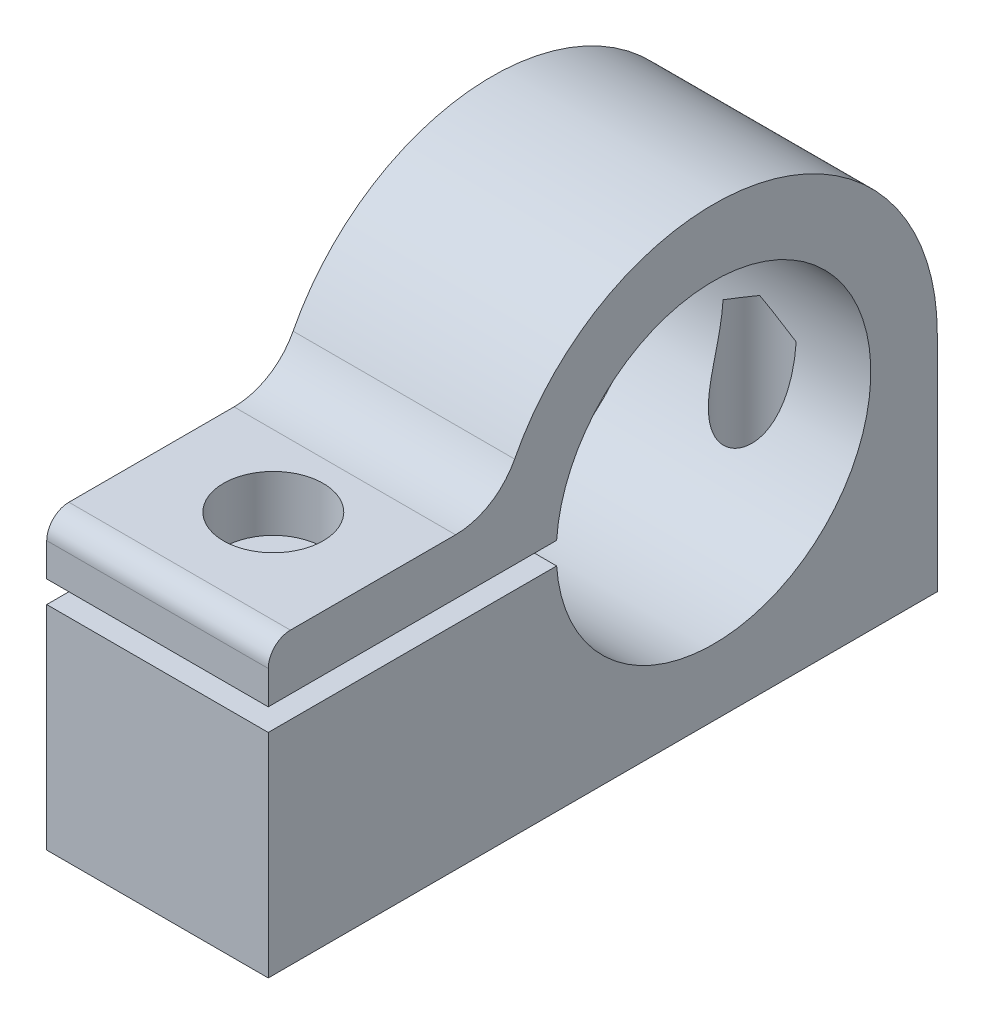
ISO-10303-21;
HEADER;
FILE_DESCRIPTION(('STEP AP214'),'2;1');
FILE_NAME('part.step','',(''),(''),'','','');
FILE_SCHEMA(('AUTOMOTIVE_DESIGN { 1 0 10303 214 1 1 1 1 }'));
ENDSEC;
DATA;
#1=APPLICATION_CONTEXT('core data for automotive mechanical design processes');
#2=APPLICATION_PROTOCOL_DEFINITION('international standard','automotive_design',2000,#1);
#3=PRODUCT_CONTEXT('',#1,'mechanical');
#4=PRODUCT('Part','Part','',(#3));
#5=PRODUCT_RELATED_PRODUCT_CATEGORY('part','',(#4));
#6=PRODUCT_DEFINITION_FORMATION('','',#4);
#7=PRODUCT_DEFINITION_CONTEXT('part definition',#1,'design');
#8=PRODUCT_DEFINITION('design','',#6,#7);
#9=PRODUCT_DEFINITION_SHAPE('','',#8);
#10=(LENGTH_UNIT() NAMED_UNIT(*) SI_UNIT(.MILLI.,.METRE.));
#11=(NAMED_UNIT(*) PLANE_ANGLE_UNIT() SI_UNIT($,.RADIAN.));
#12=(NAMED_UNIT(*) SI_UNIT($,.STERADIAN.) SOLID_ANGLE_UNIT());
#13=UNCERTAINTY_MEASURE_WITH_UNIT(LENGTH_MEASURE(1.E-05),#10,'distance_accuracy_value','');
#14=(GEOMETRIC_REPRESENTATION_CONTEXT(3) GLOBAL_UNCERTAINTY_ASSIGNED_CONTEXT((#13)) GLOBAL_UNIT_ASSIGNED_CONTEXT((#10,
#11,#12)) REPRESENTATION_CONTEXT('',''));
#15=CARTESIAN_POINT('',(0.,0.,0.));
#16=DIRECTION('',(0.,0.,1.));
#17=DIRECTION('',(1.,0.,0.));
#18=AXIS2_PLACEMENT_3D('',#15,#16,#17);
#19=CARTESIAN_POINT('',(0.,-0.5,7.08237248385031));
#20=DIRECTION('',(0.,-1.,0.));
#21=DIRECTION('',(0.,0.,-1.));
#22=AXIS2_PLACEMENT_3D('',#19,#20,#21);
#23=PLANE('',#22);
#24=CARTESIAN_POINT('',(5.,-0.5,14.8720846114518));
#25=DIRECTION('',(0.,-1.,0.));
#26=DIRECTION('',(0.,0.,-1.));
#27=AXIS2_PLACEMENT_3D('',#24,#25,#26);
#28=CIRCLE('',#27,1.64999999999999);
#29=CARTESIAN_POINT('',(5.,-0.5,13.2220846114518));
#30=VERTEX_POINT('',#29);
#31=EDGE_CURVE('E228',#30,#30,#28,.F.);
#32=ORIENTED_EDGE('',*,*,#31,.F.);
#33=EDGE_LOOP('',(#32));
#34=FACE_BOUND('',#33,.T.);
#35=DIRECTION('',(0.,0.,-1.));
#36=VECTOR('',#35,1.);
#37=CARTESIAN_POINT('',(10.,-0.5,7.08237248385031));
#38=LINE('',#37,#36);
#39=CARTESIAN_POINT('',(10.,-0.5,20.1));
#40=VERTEX_POINT('',#39);
#41=CARTESIAN_POINT('',(10.,-0.5,7.08237248385031));
#42=VERTEX_POINT('',#41);
#43=EDGE_CURVE('E434',#40,#42,#38,.T.);
#44=ORIENTED_EDGE('',*,*,#43,.T.);
#45=DIRECTION('',(1.,0.,0.));
#46=VECTOR('',#45,1.);
#47=CARTESIAN_POINT('',(0.,-0.499999999999997,7.08237248385031));
#48=LINE('',#47,#46);
#49=CARTESIAN_POINT('',(0.,-0.499999999999997,7.08237248385031));
#50=VERTEX_POINT('',#49);
#51=EDGE_CURVE('E260',#50,#42,#48,.T.);
#52=ORIENTED_EDGE('',*,*,#51,.F.);
#53=DIRECTION('',(0.,0.,-1.));
#54=VECTOR('',#53,1.);
#55=CARTESIAN_POINT('',(0.,-0.5,7.08237248385031));
#56=LINE('',#55,#54);
#57=CARTESIAN_POINT('',(0.,-0.5,20.1));
#58=VERTEX_POINT('',#57);
#59=EDGE_CURVE('E264',#58,#50,#56,.T.);
#60=ORIENTED_EDGE('',*,*,#59,.F.);
#61=DIRECTION('',(1.,0.,0.));
#62=VECTOR('',#61,1.);
#63=CARTESIAN_POINT('',(0.,-0.5,20.1));
#64=LINE('',#63,#62);
#65=EDGE_CURVE('E430',#58,#40,#64,.T.);
#66=ORIENTED_EDGE('',*,*,#65,.T.);
#67=EDGE_LOOP('',(#44,#52,#60,#66));
#68=FACE_BOUND('',#67,.T.);
#69=CARTESIAN_POINT('',(5.,-0.5,9.85222854765104));
#70=DIRECTION('',(0.,-1.,0.));
#71=DIRECTION('',(0.,0.,-1.));
#72=AXIS2_PLACEMENT_3D('',#69,#70,#71);
#73=CIRCLE('',#72,1.64999999999999);
#74=CARTESIAN_POINT('',(5.,-0.5,8.20222854765105));
#75=VERTEX_POINT('',#74);
#76=EDGE_CURVE('E449',#75,#75,#73,.F.);
#77=ORIENTED_EDGE('',*,*,#76,.F.);
#78=EDGE_LOOP('',(#77));
#79=FACE_BOUND('',#78,.T.);
#80=ADVANCED_FACE('F37',(#34,#68,#79),#23,.F.);
#81=CARTESIAN_POINT('',(0.,0.5,7.08237248385031));
#82=DIRECTION('',(0.,1.,0.));
#83=DIRECTION('',(0.,0.,1.));
#84=AXIS2_PLACEMENT_3D('',#81,#82,#83);
#85=PLANE('',#84);
#86=DIRECTION('',(0.,0.,1.));
#87=VECTOR('',#86,1.);
#88=CARTESIAN_POINT('',(10.,0.5,7.08237248385031));
#89=LINE('',#88,#87);
#90=CARTESIAN_POINT('',(10.,0.5,7.08237248385031));
#91=VERTEX_POINT('',#90);
#92=CARTESIAN_POINT('',(10.,0.5,20.1));
#93=VERTEX_POINT('',#92);
#94=EDGE_CURVE('E435',#91,#93,#89,.T.);
#95=ORIENTED_EDGE('',*,*,#94,.T.);
#96=DIRECTION('',(1.,0.,0.));
#97=VECTOR('',#96,1.);
#98=CARTESIAN_POINT('',(0.,0.5,20.1));
#99=LINE('',#98,#97);
#100=CARTESIAN_POINT('',(0.,0.5,20.1));
#101=VERTEX_POINT('',#100);
#102=EDGE_CURVE('E232',#101,#93,#99,.T.);
#103=ORIENTED_EDGE('',*,*,#102,.F.);
#104=DIRECTION('',(0.,0.,1.));
#105=VECTOR('',#104,1.);
#106=CARTESIAN_POINT('',(0.,0.5,7.08237248385031));
#107=LINE('',#106,#105);
#108=CARTESIAN_POINT('',(0.,0.5,7.08237248385031));
#109=VERTEX_POINT('',#108);
#110=EDGE_CURVE('E200',#109,#101,#107,.T.);
#111=ORIENTED_EDGE('',*,*,#110,.F.);
#112=DIRECTION('',(1.,0.,0.));
#113=VECTOR('',#112,1.);
#114=CARTESIAN_POINT('',(0.,0.5,7.08237248385031));
#115=LINE('',#114,#113);
#116=EDGE_CURVE('E254',#109,#91,#115,.T.);
#117=ORIENTED_EDGE('',*,*,#116,.T.);
#118=EDGE_LOOP('',(#95,#103,#111,#117));
#119=FACE_BOUND('',#118,.T.);
#120=CARTESIAN_POINT('',(5.,0.5,14.8720846114518));
#121=DIRECTION('',(0.,1.,0.));
#122=DIRECTION('',(0.,0.,1.));
#123=AXIS2_PLACEMENT_3D('',#120,#121,#122);
#124=CIRCLE('',#123,2.25);
#125=CARTESIAN_POINT('',(5.,0.5,17.1220846114518));
#126=VERTEX_POINT('',#125);
#127=EDGE_CURVE('E436',#126,#126,#124,.F.);
#128=ORIENTED_EDGE('',*,*,#127,.F.);
#129=EDGE_LOOP('',(#128));
#130=FACE_BOUND('',#129,.T.);
#131=ADVANCED_FACE('F144',(#119,#130),#85,.F.);
#132=CARTESIAN_POINT('',(10.,0.,20.1));
#133=DIRECTION('',(0.,0.,-1.));
#134=DIRECTION('',(-1.,0.,0.));
#135=AXIS2_PLACEMENT_3D('',#132,#133,#134);
#136=PLANE('',#135);
#137=DIRECTION('',(0.,-1.,0.));
#138=VECTOR('',#137,1.);
#139=CARTESIAN_POINT('',(10.,0.,20.1));
#140=LINE('',#139,#138);
#141=CARTESIAN_POINT('',(10.,2.,20.1));
#142=VERTEX_POINT('',#141);
#143=EDGE_CURVE('E194',#142,#93,#140,.T.);
#144=ORIENTED_EDGE('',*,*,#143,.F.);
#145=DIRECTION('',(-1.,0.,0.));
#146=VECTOR('',#145,1.);
#147=CARTESIAN_POINT('',(10.,2.,20.1));
#148=LINE('',#147,#146);
#149=CARTESIAN_POINT('',(0.,2.,20.1));
#150=VERTEX_POINT('',#149);
#151=EDGE_CURVE('E184',#142,#150,#148,.T.);
#152=ORIENTED_EDGE('',*,*,#151,.T.);
#153=DIRECTION('',(0.,-1.,0.));
#154=VECTOR('',#153,1.);
#155=CARTESIAN_POINT('',(0.,0.,20.1));
#156=LINE('',#155,#154);
#157=EDGE_CURVE('E192',#150,#101,#156,.T.);
#158=ORIENTED_EDGE('',*,*,#157,.T.);
#159=ORIENTED_EDGE('',*,*,#102,.T.);
#160=EDGE_LOOP('',(#144,#152,#158,#159));
#161=FACE_BOUND('',#160,.T.);
#162=ADVANCED_FACE('F150',(#161),#136,.F.);
#163=CARTESIAN_POINT('',(10.,0.,0.));
#164=DIRECTION('',(1.,0.,0.));
#165=DIRECTION('',(0.,0.,-1.));
#166=AXIS2_PLACEMENT_3D('',#163,#164,#165);
#167=PLANE('',#166);
#168=DIRECTION('',(0.,0.,1.));
#169=VECTOR('',#168,1.);
#170=CARTESIAN_POINT('',(10.,3.,20.1));
#171=LINE('',#170,#169);
#172=CARTESIAN_POINT('',(10.,3.,11.6451706728583));
#173=VERTEX_POINT('',#172);
#174=CARTESIAN_POINT('',(10.,3.,19.1));
#175=VERTEX_POINT('',#174);
#176=EDGE_CURVE('E208',#173,#175,#171,.T.);
#177=ORIENTED_EDGE('',*,*,#176,.T.);
#178=CARTESIAN_POINT('',(10.,2.,19.1));
#179=DIRECTION('',(1.,0.,0.));
#180=DIRECTION('',(0.,0.,-1.));
#181=AXIS2_PLACEMENT_3D('',#178,#179,#180);
#182=CIRCLE('',#181,1.);
#183=EDGE_CURVE('E11',#175,#142,#182,.T.);
#184=ORIENTED_EDGE('',*,*,#183,.T.);
#185=ORIENTED_EDGE('',*,*,#143,.T.);
#186=ORIENTED_EDGE('',*,*,#94,.F.);
#187=CARTESIAN_POINT('',(10.,0.,0.));
#188=DIRECTION('',(1.,0.,0.));
#189=DIRECTION('',(0.,0.,-1.));
#190=AXIS2_PLACEMENT_3D('',#187,#188,#189);
#191=CIRCLE('',#190,7.1);
#192=EDGE_CURVE('E206',#42,#91,#191,.T.);
#193=ORIENTED_EDGE('',*,*,#192,.F.);
#194=ORIENTED_EDGE('',*,*,#43,.F.);
#195=CARTESIAN_POINT('',(10.,-10.1,20.1));
#196=VERTEX_POINT('',#195);
#197=EDGE_CURVE('E217',#40,#196,#140,.T.);
#198=ORIENTED_EDGE('',*,*,#197,.T.);
#199=DIRECTION('',(0.,0.,-1.));
#200=VECTOR('',#199,1.);
#201=CARTESIAN_POINT('',(10.,-10.1,20.1));
#202=LINE('',#201,#200);
#203=CARTESIAN_POINT('',(10.,-10.1,-10.1));
#204=VERTEX_POINT('',#203);
#205=EDGE_CURVE('E271',#196,#204,#202,.T.);
#206=ORIENTED_EDGE('',*,*,#205,.T.);
#207=DIRECTION('',(0.,1.,0.));
#208=VECTOR('',#207,1.);
#209=CARTESIAN_POINT('',(10.,0.,-10.1));
#210=LINE('',#209,#208);
#211=CARTESIAN_POINT('',(10.,0.,-10.1));
#212=VERTEX_POINT('',#211);
#213=EDGE_CURVE('E273',#204,#212,#210,.T.);
#214=ORIENTED_EDGE('',*,*,#213,.T.);
#215=CARTESIAN_POINT('',(10.,0.,0.));
#216=DIRECTION('',(1.,0.,0.));
#217=DIRECTION('',(0.,0.,-1.));
#218=AXIS2_PLACEMENT_3D('',#215,#216,#217);
#219=CIRCLE('',#218,10.1);
#220=CARTESIAN_POINT('',(10.,4.62595419847328,8.97833769434117));
#221=VERTEX_POINT('',#220);
#222=EDGE_CURVE('E274',#212,#221,#219,.T.);
#223=ORIENTED_EDGE('',*,*,#222,.T.);
#224=CARTESIAN_POINT('',(10.,6.,11.6451706728583));
#225=DIRECTION('',(1.,0.,0.));
#226=DIRECTION('',(0.,0.,-1.));
#227=AXIS2_PLACEMENT_3D('',#224,#225,#226);
#228=CIRCLE('',#227,3.);
#229=EDGE_CURVE('E238',#221,#173,#228,.F.);
#230=ORIENTED_EDGE('',*,*,#229,.T.);
#231=EDGE_LOOP('',(#177,#184,#185,#186,#193,#194,#198,#206,#214,#223,#230));
#232=FACE_BOUND('',#231,.T.);
#233=ADVANCED_FACE('F168',(#232),#167,.T.);
#234=CARTESIAN_POINT('',(0.,0.,0.));
#235=DIRECTION('',(1.,0.,0.));
#236=DIRECTION('',(0.,0.,-1.));
#237=AXIS2_PLACEMENT_3D('',#234,#235,#236);
#238=PLANE('',#237);
#239=ORIENTED_EDGE('',*,*,#157,.F.);
#240=CARTESIAN_POINT('',(0.,2.,19.1));
#241=DIRECTION('',(1.,0.,0.));
#242=DIRECTION('',(0.,0.,-1.));
#243=AXIS2_PLACEMENT_3D('',#240,#241,#242);
#244=CIRCLE('',#243,1.);
#245=CARTESIAN_POINT('',(0.,3.,19.1));
#246=VERTEX_POINT('',#245);
#247=EDGE_CURVE('E59',#150,#246,#244,.F.);
#248=ORIENTED_EDGE('',*,*,#247,.T.);
#249=DIRECTION('',(0.,0.,1.));
#250=VECTOR('',#249,1.);
#251=CARTESIAN_POINT('',(0.,3.,20.1));
#252=LINE('',#251,#250);
#253=CARTESIAN_POINT('',(0.,3.,11.6451706728583));
#254=VERTEX_POINT('',#253);
#255=EDGE_CURVE('E215',#254,#246,#252,.T.);
#256=ORIENTED_EDGE('',*,*,#255,.F.);
#257=CARTESIAN_POINT('',(0.,6.,11.6451706728583));
#258=DIRECTION('',(1.,0.,0.));
#259=DIRECTION('',(0.,0.,-1.));
#260=AXIS2_PLACEMENT_3D('',#257,#258,#259);
#261=CIRCLE('',#260,3.);
#262=CARTESIAN_POINT('',(0.,4.62595419847328,8.97833769434117));
#263=VERTEX_POINT('',#262);
#264=EDGE_CURVE('E237',#254,#263,#261,.T.);
#265=ORIENTED_EDGE('',*,*,#264,.T.);
#266=CARTESIAN_POINT('',(0.,0.,0.));
#267=DIRECTION('',(1.,0.,0.));
#268=DIRECTION('',(0.,0.,-1.));
#269=AXIS2_PLACEMENT_3D('',#266,#267,#268);
#270=CIRCLE('',#269,10.1);
#271=CARTESIAN_POINT('',(0.,0.,-10.1));
#272=VERTEX_POINT('',#271);
#273=EDGE_CURVE('E212',#272,#263,#270,.T.);
#274=ORIENTED_EDGE('',*,*,#273,.F.);
#275=DIRECTION('',(0.,1.,0.));
#276=VECTOR('',#275,1.);
#277=CARTESIAN_POINT('',(0.,0.,-10.1));
#278=LINE('',#277,#276);
#279=CARTESIAN_POINT('',(0.,-10.1,-10.1));
#280=VERTEX_POINT('',#279);
#281=EDGE_CURVE('E204',#280,#272,#278,.T.);
#282=ORIENTED_EDGE('',*,*,#281,.F.);
#283=DIRECTION('',(0.,0.,-1.));
#284=VECTOR('',#283,1.);
#285=CARTESIAN_POINT('',(0.,-10.1,-10.1));
#286=LINE('',#285,#284);
#287=CARTESIAN_POINT('',(0.,-10.1,20.1));
#288=VERTEX_POINT('',#287);
#289=EDGE_CURVE('E201',#288,#280,#286,.T.);
#290=ORIENTED_EDGE('',*,*,#289,.F.);
#291=EDGE_CURVE('E202',#58,#288,#156,.T.);
#292=ORIENTED_EDGE('',*,*,#291,.F.);
#293=ORIENTED_EDGE('',*,*,#59,.T.);
#294=CARTESIAN_POINT('',(0.,0.,0.));
#295=DIRECTION('',(1.,0.,0.));
#296=DIRECTION('',(0.,0.,-1.));
#297=AXIS2_PLACEMENT_3D('',#294,#295,#296);
#298=CIRCLE('',#297,7.1);
#299=EDGE_CURVE('E256',#50,#109,#298,.T.);
#300=ORIENTED_EDGE('',*,*,#299,.T.);
#301=ORIENTED_EDGE('',*,*,#110,.T.);
#302=EDGE_LOOP('',(#239,#248,#256,#265,#274,#282,#290,#292,#293,#300,#301));
#303=FACE_BOUND('',#302,.T.);
#304=ADVANCED_FACE('F198',(#303),#238,.F.);
#305=ORIENTED_EDGE('',*,*,#197,.F.);
#306=ORIENTED_EDGE('',*,*,#65,.F.);
#307=ORIENTED_EDGE('',*,*,#291,.T.);
#308=DIRECTION('',(-1.,0.,0.));
#309=VECTOR('',#308,1.);
#310=CARTESIAN_POINT('',(10.,-10.1,20.1));
#311=LINE('',#310,#309);
#312=EDGE_CURVE('E224',#196,#288,#311,.T.);
#313=ORIENTED_EDGE('',*,*,#312,.F.);
#314=EDGE_LOOP('',(#305,#306,#307,#313));
#315=FACE_BOUND('',#314,.T.);
#316=ADVANCED_FACE('F347',(#315),#136,.F.);
#317=CARTESIAN_POINT('',(10.,-10.1,-10.1));
#318=DIRECTION('',(0.,1.,0.));
#319=DIRECTION('',(0.,0.,1.));
#320=AXIS2_PLACEMENT_3D('',#317,#318,#319);
#321=PLANE('',#320);
#322=CARTESIAN_POINT('',(5.,-10.1,-7.1));
#323=DIRECTION('',(0.,-1.,0.));
#324=DIRECTION('',(0.,0.,-1.));
#325=AXIS2_PLACEMENT_3D('',#322,#323,#324);
#326=CIRCLE('',#325,1.64999999999999);
#327=CARTESIAN_POINT('',(5.,-10.1,-8.74999999999999));
#328=VERTEX_POINT('',#327);
#329=EDGE_CURVE('E248',#328,#328,#326,.T.);
#330=ORIENTED_EDGE('',*,*,#329,.F.);
#331=EDGE_LOOP('',(#330));
#332=FACE_BOUND('',#331,.T.);
#333=CARTESIAN_POINT('',(5.,-10.1,9.85222854765104));
#334=DIRECTION('',(0.,-1.,0.));
#335=DIRECTION('',(0.,0.,-1.));
#336=AXIS2_PLACEMENT_3D('',#333,#334,#335);
#337=CIRCLE('',#336,1.64999999999999);
#338=CARTESIAN_POINT('',(5.,-10.1,8.20222854765105));
#339=VERTEX_POINT('',#338);
#340=EDGE_CURVE('E247',#339,#339,#337,.T.);
#341=ORIENTED_EDGE('',*,*,#340,.F.);
#342=EDGE_LOOP('',(#341));
#343=FACE_BOUND('',#342,.T.);
#344=CARTESIAN_POINT('',(5.,-10.1,14.8720846114518));
#345=DIRECTION('',(0.,1.,0.));
#346=DIRECTION('',(0.,0.,1.));
#347=AXIS2_PLACEMENT_3D('',#344,#345,#346);
#348=CIRCLE('',#347,1.65);
#349=CARTESIAN_POINT('',(5.,-10.1,16.5220846114518));
#350=VERTEX_POINT('',#349);
#351=EDGE_CURVE('E231',#350,#350,#348,.T.);
#352=ORIENTED_EDGE('',*,*,#351,.T.);
#353=EDGE_LOOP('',(#352));
#354=FACE_BOUND('',#353,.T.);
#355=ORIENTED_EDGE('',*,*,#289,.T.);
#356=DIRECTION('',(-1.,0.,0.));
#357=VECTOR('',#356,1.);
#358=CARTESIAN_POINT('',(10.,-10.1,-10.1));
#359=LINE('',#358,#357);
#360=EDGE_CURVE('E221',#204,#280,#359,.T.);
#361=ORIENTED_EDGE('',*,*,#360,.F.);
#362=ORIENTED_EDGE('',*,*,#205,.F.);
#363=ORIENTED_EDGE('',*,*,#312,.T.);
#364=EDGE_LOOP('',(#355,#361,#362,#363));
#365=FACE_BOUND('',#364,.T.);
#366=ADVANCED_FACE('F340',(#332,#343,#354,#365),#321,.F.);
#367=CARTESIAN_POINT('',(10.,0.,-10.1));
#368=DIRECTION('',(0.,0.,1.));
#369=DIRECTION('',(1.,0.,0.));
#370=AXIS2_PLACEMENT_3D('',#367,#368,#369);
#371=PLANE('',#370);
#372=ORIENTED_EDGE('',*,*,#281,.T.);
#373=DIRECTION('',(-1.,0.,0.));
#374=VECTOR('',#373,1.);
#375=CARTESIAN_POINT('',(10.,0.,-10.1));
#376=LINE('',#375,#374);
#377=EDGE_CURVE('E218',#212,#272,#376,.T.);
#378=ORIENTED_EDGE('',*,*,#377,.F.);
#379=ORIENTED_EDGE('',*,*,#213,.F.);
#380=ORIENTED_EDGE('',*,*,#360,.T.);
#381=EDGE_LOOP('',(#372,#378,#379,#380));
#382=FACE_BOUND('',#381,.T.);
#383=ADVANCED_FACE('F332',(#382),#371,.F.);
#384=CARTESIAN_POINT('',(10.,0.,0.));
#385=DIRECTION('',(-1.,0.,0.));
#386=DIRECTION('',(0.,0.,1.));
#387=AXIS2_PLACEMENT_3D('',#384,#385,#386);
#388=CYLINDRICAL_SURFACE('',#387,10.1);
#389=ORIENTED_EDGE('',*,*,#273,.T.);
#390=DIRECTION('',(-1.,0.,0.));
#391=VECTOR('',#390,1.);
#392=CARTESIAN_POINT('',(10.,4.62595419847328,8.97833769434117));
#393=LINE('',#392,#391);
#394=EDGE_CURVE('E235',#263,#221,#393,.F.);
#395=ORIENTED_EDGE('',*,*,#394,.T.);
#396=ORIENTED_EDGE('',*,*,#222,.F.);
#397=ORIENTED_EDGE('',*,*,#377,.T.);
#398=EDGE_LOOP('',(#389,#395,#396,#397));
#399=FACE_BOUND('',#398,.T.);
#400=ADVANCED_FACE('F324',(#399),#388,.T.);
#401=CARTESIAN_POINT('',(10.,3.,20.1));
#402=DIRECTION('',(0.,-1.,0.));
#403=DIRECTION('',(0.,0.,-1.));
#404=AXIS2_PLACEMENT_3D('',#401,#402,#403);
#405=PLANE('',#404);
#406=CARTESIAN_POINT('',(5.,3.,14.8720846114518));
#407=DIRECTION('',(0.,1.,0.));
#408=DIRECTION('',(0.,0.,1.));
#409=AXIS2_PLACEMENT_3D('',#406,#407,#408);
#410=CIRCLE('',#409,2.25);
#411=CARTESIAN_POINT('',(5.,3.,17.1220846114518));
#412=VERTEX_POINT('',#411);
#413=EDGE_CURVE('E440',#412,#412,#410,.T.);
#414=ORIENTED_EDGE('',*,*,#413,.F.);
#415=EDGE_LOOP('',(#414));
#416=FACE_BOUND('',#415,.T.);
#417=ORIENTED_EDGE('',*,*,#255,.T.);
#418=DIRECTION('',(-1.,0.,0.));
#419=VECTOR('',#418,1.);
#420=CARTESIAN_POINT('',(10.,3.,19.1));
#421=LINE('',#420,#419);
#422=EDGE_CURVE('E45',#246,#175,#421,.F.);
#423=ORIENTED_EDGE('',*,*,#422,.T.);
#424=ORIENTED_EDGE('',*,*,#176,.F.);
#425=DIRECTION('',(1.,0.,0.));
#426=VECTOR('',#425,1.);
#427=CARTESIAN_POINT('',(0.,3.,11.6451706728583));
#428=LINE('',#427,#426);
#429=EDGE_CURVE('E227',#173,#254,#428,.F.);
#430=ORIENTED_EDGE('',*,*,#429,.T.);
#431=EDGE_LOOP('',(#417,#423,#424,#430));
#432=FACE_BOUND('',#431,.T.);
#433=ADVANCED_FACE('F166',(#416,#432),#405,.F.);
#434=CARTESIAN_POINT('',(10.,0.,0.));
#435=DIRECTION('',(-1.,0.,0.));
#436=DIRECTION('',(0.,0.,1.));
#437=AXIS2_PLACEMENT_3D('',#434,#435,#436);
#438=CYLINDRICAL_SURFACE('',#437,7.1);
#439=CARTESIAN_POINT('',(3.35009416308858,-0.499999999999999,-7.08237248385031));
#440=CARTESIAN_POINT('',(3.35018086543623,-0.59568997380326,-7.07561818978922));
#441=CARTESIAN_POINT('',(3.35030122893694,-0.691243458275906,-7.06692219080937));
#442=CARTESIAN_POINT('',(3.35085668170009,-0.881926015575505,-7.04566572940908));
#443=CARTESIAN_POINT('',(3.35129179515601,-0.977055055211587,-7.03310496996358));
#444=CARTESIAN_POINT('',(3.35272651715384,-1.16702748695656,-7.0040924053882));
#445=CARTESIAN_POINT('',(3.35372793645035,-1.2618689767939,-6.98762821766165));
#446=CARTESIAN_POINT('',(3.35665016279378,-1.45078855893671,-6.95086126627778));
#447=CARTESIAN_POINT('',(3.35857093890455,-1.54486667682115,-6.93055863179724));
#448=CARTESIAN_POINT('',(3.36378073289358,-1.73270835299993,-6.88600759606295));
#449=CARTESIAN_POINT('',(3.36707874923006,-1.82646567705896,-6.86173389547613));
#450=CARTESIAN_POINT('',(3.37557609204437,-2.01282849086809,-6.80939701210566));
#451=CARTESIAN_POINT('',(3.38077532221178,-2.10543403871843,-6.78133402132275));
#452=CARTESIAN_POINT('',(3.39369655110777,-2.28911679600524,-6.72155170720894));
#453=CARTESIAN_POINT('',(3.40141444351593,-2.38019624111604,-6.68983838932937));
#454=CARTESIAN_POINT('',(3.42011383194556,-2.56068038718671,-6.62285247866792));
#455=CARTESIAN_POINT('',(3.43109437946171,-2.65008556686295,-6.58758092228773));
#456=CARTESIAN_POINT('',(3.45327108408441,-2.80031360847855,-6.52477873148719));
#457=CARTESIAN_POINT('',(3.46341099409379,-2.8616524781082,-6.4981068031111));
#458=CARTESIAN_POINT('',(3.48606016439334,-2.98319317158879,-6.44321381464319));
#459=CARTESIAN_POINT('',(3.49856938792584,-3.04339501306371,-6.41499277858914));
#460=CARTESIAN_POINT('',(3.52633727189756,-3.16246969748229,-6.35713481219898));
#461=CARTESIAN_POINT('',(3.54159556968491,-3.22134271457021,-6.32749806899836));
#462=CARTESIAN_POINT('',(3.57528896703342,-3.33752054261221,-6.26699726719862));
#463=CARTESIAN_POINT('',(3.59372402934297,-3.39482537194614,-6.23613322299442));
#464=CARTESIAN_POINT('',(3.65491659355216,-3.56518784344066,-6.14136612948778));
#465=CARTESIAN_POINT('',(3.70329651121852,-3.67546288288542,-6.07588918602247));
#466=CARTESIAN_POINT('',(3.81927152743708,-3.88490883671912,-5.94412662945268));
#467=CARTESIAN_POINT('',(3.88681009141967,-3.98411124227253,-5.87784393678521));
#468=CARTESIAN_POINT('',(4.01279316028347,-4.12865432535091,-5.77655434060209));
#469=CARTESIAN_POINT('',(4.06363463228109,-4.17941522060597,-5.73985570523455));
#470=CARTESIAN_POINT('',(4.17402750542658,-4.27352314463292,-5.67013259641436));
#471=CARTESIAN_POINT('',(4.23356997301721,-4.31687767986218,-5.63710441491326));
#472=CARTESIAN_POINT('',(4.35165108611948,-4.38841878326553,-5.58153462284537));
#473=CARTESIAN_POINT('',(4.40900343991739,-4.41790470380517,-5.55816325912359));
#474=CARTESIAN_POINT('',(4.52918490254186,-4.46879870135088,-5.51732781746529));
#475=CARTESIAN_POINT('',(4.59201144507539,-4.49021053866113,-5.4998609900307));
#476=CARTESIAN_POINT('',(4.72213857260152,-4.52388646015858,-5.47219695082843));
#477=CARTESIAN_POINT('',(4.78946728522693,-4.53608575551794,-5.46205124791405));
#478=CARTESIAN_POINT('',(4.92592213290819,-4.55026628811916,-5.45024486844669));
#479=CARTESIAN_POINT('',(4.99504727291651,-4.55225306577971,-5.44857959116119));
#480=CARTESIAN_POINT('',(5.12422032475244,-4.54627493924888,-5.45356656783252));
#481=CARTESIAN_POINT('',(5.1843656024735,-4.53947119302751,-5.45924840361306));
#482=CARTESIAN_POINT('',(5.30233089080887,-4.51823248701083,-5.47683883351714));
#483=CARTESIAN_POINT('',(5.36015098864864,-4.50379781376567,-5.48874719382728));
#484=CARTESIAN_POINT('',(5.47294449478314,-4.46773364658131,-5.51814261044867));
#485=CARTESIAN_POINT('',(5.52786475625502,-4.44600329274549,-5.5357077219343));
#486=CARTESIAN_POINT('',(5.63307997666889,-4.39632156690315,-5.57524593117818));
#487=CARTESIAN_POINT('',(5.68337269560092,-4.36836720425733,-5.59722114749155));
#488=CARTESIAN_POINT('',(5.80212109748773,-4.29229900381435,-5.65592025967057));
#489=CARTESIAN_POINT('',(5.86755128323717,-4.24098439223172,-5.69462719453724));
#490=CARTESIAN_POINT('',(5.98736828717722,-4.12943144080581,-5.77603708187289));
#491=CARTESIAN_POINT('',(6.04173017112442,-4.06917346991878,-5.81874874695642));
#492=CARTESIAN_POINT('',(6.1655528269853,-3.90943873068733,-5.92787721465563));
#493=CARTESIAN_POINT('',(6.22854892674247,-3.80564758724789,-5.99526173669963));
#494=CARTESIAN_POINT('',(6.33611117445881,-3.58790627607205,-6.12807781178503));
#495=CARTESIAN_POINT('',(6.38063866530583,-3.47393540044981,-6.19350500511237));
#496=CARTESIAN_POINT('',(6.45098258119383,-3.25345087808971,-6.31179520083988));
#497=CARTESIAN_POINT('',(6.47842332190375,-3.14773504816122,-6.36521532156822));
#498=CARTESIAN_POINT('',(6.52492163437874,-2.93220381141193,-6.46733483362664));
#499=CARTESIAN_POINT('',(6.54397255299928,-2.82238522568886,-6.516030454648));
#500=CARTESIAN_POINT('',(6.57576061119497,-2.59927417806616,-6.6082070292304));
#501=CARTESIAN_POINT('',(6.58847582649519,-2.48597107425725,-6.65166948579998));
#502=CARTESIAN_POINT('',(6.60917699624498,-2.25689395809093,-6.73284512203975));
#503=CARTESIAN_POINT('',(6.61716195408801,-2.14111943035459,-6.77055708891115));
#504=CARTESIAN_POINT('',(6.63019042449775,-1.89986090377151,-6.84232444272078));
#505=CARTESIAN_POINT('',(6.63500310955323,-1.77424308105913,-6.87597009046795));
#506=CARTESIAN_POINT('',(6.64214306282561,-1.52127332327307,-6.93632774987245));
#507=CARTESIAN_POINT('',(6.64446995062269,-1.39392112579461,-6.96303869978866));
#508=CARTESIAN_POINT('',(6.64765980695009,-1.13924801175887,-7.00918574667449));
#509=CARTESIAN_POINT('',(6.64853771060075,-1.01194047418389,-7.02869443283838));
#510=CARTESIAN_POINT('',(6.64934199380922,-0.820358341310095,-7.05274095874707));
#511=CARTESIAN_POINT('',(6.64952466828016,-0.756401836879036,-7.05988650796461));
#512=CARTESIAN_POINT('',(6.64978128985435,-0.628318513529428,-7.0724363567018));
#513=CARTESIAN_POINT('',(6.64985523785348,-0.564191696018589,-7.0778406705686));
#514=CARTESIAN_POINT('',(6.64990583691142,-0.499999999999998,-7.08237248385031));
#515=B_SPLINE_CURVE_WITH_KNOTS('',3,(#439,#440,#441,#442,#443,#444,#445,#446,#447,#448,#449,
#450,#451,#452,#453,#454,#455,#456,#457,#458,#459,#460,#461,#462,#463,#464,#465,#466,#467,#468,
#469,#470,#471,#472,#473,#474,#475,#476,#477,#478,#479,#480,#481,#482,#483,#484,#485,#486,#487,
#488,#489,#490,#491,#492,#493,#494,#495,#496,#497,#498,#499,#500,#501,#502,#503,#504,#505,#506,
#507,#508,#509,#510,#511,#512,#513,#514),.UNSPECIFIED.,.F.,.F.,(4,2,2,2,2,2,2,2,2,2,2,2,2,2,2,2,
2,2,2,2,2,2,2,2,2,2,2,2,2,2,2,2,2,2,2,2,2,4),(0.,0.287765554205404,0.57555323007689,
0.864266348437708,1.15296975235133,1.44358972095811,1.73419496957207,2.02432877508737,
2.31437831651595,2.51727179154959,2.72016211913969,2.92302570145201,3.12588690509354,
3.5357677632639,3.9444514805939,4.18576602907879,4.42683453162131,4.63178339969877,
4.83663669968527,5.04291758390137,5.24908654633527,5.43061171135585,5.61213006038037,
5.79626890533006,5.98049642076845,6.2541009271157,6.52831514079604,6.9425522863738,
7.35765215915985,7.72188096827558,8.0863980936888,8.45216799480446,8.81801493171703,
9.20818245783066,9.59840968559831,9.98458901551758,10.1776325621947,10.3706745182223),.UNSPECIFIED.);
#516=CARTESIAN_POINT('',(3.35009416308858,-0.499999999999999,-7.08237248385031));
#517=VERTEX_POINT('',#516);
#518=CARTESIAN_POINT('',(6.64990583691142,-0.499999999999999,-7.08237248385031));
#519=VERTEX_POINT('',#518);
#520=EDGE_CURVE('E178',#517,#519,#515,.T.);
#521=ORIENTED_EDGE('',*,*,#520,.F.);
#522=CARTESIAN_POINT('',(6.81515596374642,-0.599342002139546,-7.07465823658439));
#523=CARTESIAN_POINT('',(6.67666063340507,-0.516072945577056,-7.08171053440118));
#524=CARTESIAN_POINT('',(6.53809899682568,-0.432791637369677,-7.08728705895271));
#525=CARTESIAN_POINT('',(6.26090322954261,-0.26621033847347,-7.0954981484728));
#526=CARTESIAN_POINT('',(6.12226910021613,-0.182910348155586,-7.09813276743498));
#527=CARTESIAN_POINT('',(5.82684764740956,-0.00539702157419792,-7.10062274924323));
#528=CARTESIAN_POINT('',(5.67005789010051,0.0888185331707848,-7.10006947951678));
#529=CARTESIAN_POINT('',(5.42950332726086,0.233338092840888,-7.09634337642283));
#530=CARTESIAN_POINT('',(5.34572784400472,0.2836627530289,-7.09451016570704));
#531=CARTESIAN_POINT('',(5.21876931966402,0.359874715317826,-7.09092105321179));
#532=CARTESIAN_POINT('',(5.17558963595543,0.385785746413839,-7.08955822944303));
#533=CARTESIAN_POINT('',(5.12133906205572,0.418139966240765,-7.08767962139488));
#534=CARTESIAN_POINT('',(5.1103302819735,0.424695119534688,-7.08728983132013));
#535=CARTESIAN_POINT('',(5.08829029350303,0.437766582437037,-7.08649441332938));
#536=CARTESIAN_POINT('',(5.07725908587983,0.444282893341559,-7.08608878594529));
#537=CARTESIAN_POINT('',(5.06053822017973,0.454020001462117,-7.0854694120237));
#538=CARTESIAN_POINT('',(5.0548780008217,0.457292048408933,-7.0852589675156));
#539=CARTESIAN_POINT('',(5.04351364137179,0.463758400117905,-7.08483863535671));
#540=CARTESIAN_POINT('',(5.03780951434468,0.466952726911767,-7.0846287475635));
#541=CARTESIAN_POINT('',(5.02908749107981,0.471581360636849,-7.0843216700565));
#542=CARTESIAN_POINT('',(5.02612087609391,0.473112075603421,-7.0842195874575));
#543=CARTESIAN_POINT('',(5.02009870578891,0.476033004881499,-7.08402390349927));
#544=CARTESIAN_POINT('',(5.01704283119382,0.47742260673323,-7.08393033927914));
#545=CARTESIAN_POINT('',(5.01199461709911,0.479340641076314,-7.08380075226246));
#546=CARTESIAN_POINT('',(5.01005206344631,0.479993610628495,-7.08375651669376));
#547=CARTESIAN_POINT('',(5.00610725461197,0.481007816742899,-7.08368772204021));
#548=CARTESIAN_POINT('',(5.00410595540691,0.481372354950546,-7.08366294029595));
#549=CARTESIAN_POINT('',(5.0000348989874,0.481666140952877,-7.08364297354286));
#550=CARTESIAN_POINT('',(4.99796456063624,0.481588492363724,-7.08364825743935));
#551=CARTESIAN_POINT('',(4.99386706740695,0.48102018158144,-7.08368686742304));
#552=CARTESIAN_POINT('',(4.99184066198383,0.480524875422325,-7.08372050881791));
#553=CARTESIAN_POINT('',(4.98666836436067,0.478937444139036,-7.08382804969644));
#554=CARTESIAN_POINT('',(4.98358355104104,0.477665534819533,-7.08391399264795));
#555=CARTESIAN_POINT('',(4.97750757080847,0.474909661815441,-7.08409929416647));
#556=CARTESIAN_POINT('',(4.97451676595989,0.473424977674749,-7.08419869824721));
#557=CARTESIAN_POINT('',(4.96558559151488,0.468820694066105,-7.08450538432586));
#558=CARTESIAN_POINT('',(4.95971624616204,0.465563987844057,-7.08472024602219));
#559=CARTESIAN_POINT('',(4.94235565028874,0.455758072945673,-7.0853600735777));
#560=CARTESIAN_POINT('',(4.93093946984535,0.449082442819749,-7.08578646727356));
#561=CARTESIAN_POINT('',(4.90813823363472,0.435655021123495,-7.08662474760013));
#562=CARTESIAN_POINT('',(4.89675320970625,0.428903173384626,-7.08703662246545));
#563=CARTESIAN_POINT('',(4.87406602996787,0.415406264943215,-7.08784050484935));
#564=CARTESIAN_POINT('',(4.86276376989332,0.40866138219038,-7.08823261163661));
#565=CARTESIAN_POINT('',(4.84016973691317,0.395159562497417,-7.08899814374714));
#566=CARTESIAN_POINT('',(4.82887796204579,0.388402629144484,-7.0893715738977));
#567=CARTESIAN_POINT('',(4.77236947636829,0.354566568629264,-7.09119294934872));
#568=CARTESIAN_POINT('',(4.72717809563089,0.327437367438093,-7.09249756524463));
#569=CARTESIAN_POINT('',(4.63679205295799,0.27316112222379,-7.09479539238817));
#570=CARTESIAN_POINT('',(4.59159739114579,0.246014076688744,-7.09578857250934));
#571=CARTESIAN_POINT('',(4.45576815407875,0.164415746189519,-7.09830499226828));
#572=CARTESIAN_POINT('',(4.36513143931949,0.109953244177377,-7.09935724842612));
#573=CARTESIAN_POINT('',(4.09243876016359,-0.0538993301565079,-7.10063859012428));
#574=CARTESIAN_POINT('',(3.91037153915462,-0.163290975217742,-7.09896725632154));
#575=CARTESIAN_POINT('',(3.54711328045596,-0.381579145650323,-7.09057526382647));
#576=CARTESIAN_POINT('',(3.36592181735952,-0.490475793061147,-7.08387616844814));
#577=CARTESIAN_POINT('',(3.18484403625358,-0.599342002139546,-7.07465823658439));
#578=B_SPLINE_CURVE_WITH_KNOTS('',3,(#522,#523,#524,#525,#526,#527,#528,#529,#530,#531,#532,
#533,#534,#535,#536,#537,#538,#539,#540,#541,#542,#543,#544,#545,#546,#547,#548,#549,#550,#551,
#552,#553,#554,#555,#556,#557,#558,#559,#560,#561,#562,#563,#564,#565,#566,#567,#568,#569,#570,
#571,#572,#573,#574,#575,#576,#577),.UNSPECIFIED.,.F.,.F.,(4,2,2,2,2,2,2,2,2,2,2,2,2,2,2,2,2,2,
2,2,2,2,2,2,2,2,2,4),(0.,0.485253507723139,0.970498109307038,1.51921705921108,1.8124499891595,
1.96357604298154,2.00203185436907,2.04048637529403,2.06011081022394,2.07972961573126,
2.08974891725212,2.09980999629209,2.1059490386681,2.11201674814857,2.11817934671956,
2.12441138526494,2.13439809426617,2.14441945431665,2.16455967964788,2.20425634463289,
2.2439844712012,2.28348769958884,2.32298066436915,2.48115551919584,2.63934617778571,
2.95657847773026,3.59374291634779,4.22819015800505),.UNSPECIFIED.);
#579=EDGE_CURVE('E172',#519,#517,#578,.T.);
#580=ORIENTED_EDGE('',*,*,#579,.F.);
#581=EDGE_LOOP('',(#521,#580));
#582=FACE_BOUND('',#581,.T.);
#583=ORIENTED_EDGE('',*,*,#116,.F.);
#584=ORIENTED_EDGE('',*,*,#299,.F.);
#585=ORIENTED_EDGE('',*,*,#51,.T.);
#586=ORIENTED_EDGE('',*,*,#192,.T.);
#587=EDGE_LOOP('',(#583,#584,#585,#586));
#588=FACE_BOUND('',#587,.T.);
#589=ADVANCED_FACE('F161',(#582,#588),#438,.F.);
#590=CARTESIAN_POINT('',(5.,3.,14.8720846114518));
#591=DIRECTION('',(0.,1.,0.));
#592=DIRECTION('',(0.,0.,1.));
#593=AXIS2_PLACEMENT_3D('',#590,#591,#592);
#594=CYLINDRICAL_SURFACE('',#593,1.64999999999999);
#595=ORIENTED_EDGE('',*,*,#31,.T.);
#596=EDGE_LOOP('',(#595));
#597=FACE_BOUND('',#596,.T.);
#598=ORIENTED_EDGE('',*,*,#351,.F.);
#599=EDGE_LOOP('',(#598));
#600=FACE_BOUND('',#599,.T.);
#601=ADVANCED_FACE('F157',(#597,#600),#594,.F.);
#602=CARTESIAN_POINT('',(10.,6.,11.6451706728583));
#603=DIRECTION('',(-1.,0.,0.));
#604=DIRECTION('',(0.,0.,1.));
#605=AXIS2_PLACEMENT_3D('',#602,#603,#604);
#606=CYLINDRICAL_SURFACE('',#605,3.);
#607=ORIENTED_EDGE('',*,*,#229,.F.);
#608=ORIENTED_EDGE('',*,*,#394,.F.);
#609=ORIENTED_EDGE('',*,*,#264,.F.);
#610=ORIENTED_EDGE('',*,*,#429,.F.);
#611=EDGE_LOOP('',(#607,#608,#609,#610));
#612=FACE_BOUND('',#611,.T.);
#613=ADVANCED_FACE('F160',(#612),#606,.F.);
#614=CARTESIAN_POINT('',(5.,3.,14.8720846114518));
#615=DIRECTION('',(0.,1.,0.));
#616=DIRECTION('',(0.,0.,1.));
#617=AXIS2_PLACEMENT_3D('',#614,#615,#616);
#618=CYLINDRICAL_SURFACE('',#617,2.25);
#619=ORIENTED_EDGE('',*,*,#127,.T.);
#620=EDGE_LOOP('',(#619));
#621=FACE_BOUND('',#620,.T.);
#622=ORIENTED_EDGE('',*,*,#413,.T.);
#623=EDGE_LOOP('',(#622));
#624=FACE_BOUND('',#623,.T.);
#625=ADVANCED_FACE('F139',(#621,#624),#618,.F.);
#626=CARTESIAN_POINT('',(5.,-10.1,9.85222854765104));
#627=DIRECTION('',(0.,-1.,0.));
#628=DIRECTION('',(0.,0.,-1.));
#629=AXIS2_PLACEMENT_3D('',#626,#627,#628);
#630=CYLINDRICAL_SURFACE('',#629,1.64999999999999);
#631=ORIENTED_EDGE('',*,*,#76,.T.);
#632=EDGE_LOOP('',(#631));
#633=FACE_BOUND('',#632,.T.);
#634=ORIENTED_EDGE('',*,*,#340,.T.);
#635=EDGE_LOOP('',(#634));
#636=FACE_BOUND('',#635,.T.);
#637=ADVANCED_FACE('F130',(#633,#636),#630,.F.);
#638=CARTESIAN_POINT('',(5.,-0.499999999999999,-7.1));
#639=DIRECTION('',(0.,-1.,0.));
#640=DIRECTION('',(0.,0.,-1.));
#641=AXIS2_PLACEMENT_3D('',#638,#639,#640);
#642=CONICAL_SURFACE('',#641,1.65,1.02974425867665);
#643=ORIENTED_EDGE('',*,*,#579,.T.);
#644=CARTESIAN_POINT('',(5.,-0.499999999999999,-7.1));
#645=DIRECTION('',(0.,-1.,0.));
#646=DIRECTION('',(0.,0.,-1.));
#647=AXIS2_PLACEMENT_3D('',#644,#645,#646);
#648=CIRCLE('',#647,1.65);
#649=EDGE_CURVE('E244',#517,#519,#648,.T.);
#650=ORIENTED_EDGE('',*,*,#649,.T.);
#651=EDGE_LOOP('',(#643,#650));
#652=FACE_BOUND('',#651,.T.);
#653=CARTESIAN_POINT('',(5.,0.491420021395477,-7.1));
#654=VERTEX_POINT('',#653);
#655=VERTEX_LOOP('',#654);
#656=FACE_BOUND('',#655,.T.);
#657=ADVANCED_FACE('F127',(#652,#656),#642,.F.);
#658=CARTESIAN_POINT('',(5.,-10.1,-7.1));
#659=DIRECTION('',(0.,-1.,0.));
#660=DIRECTION('',(0.,0.,-1.));
#661=AXIS2_PLACEMENT_3D('',#658,#659,#660);
#662=CYLINDRICAL_SURFACE('',#661,1.64999999999999);
#663=ORIENTED_EDGE('',*,*,#520,.T.);
#664=ORIENTED_EDGE('',*,*,#649,.F.);
#665=EDGE_LOOP('',(#663,#664));
#666=FACE_BOUND('',#665,.T.);
#667=ORIENTED_EDGE('',*,*,#329,.T.);
#668=EDGE_LOOP('',(#667));
#669=FACE_BOUND('',#668,.T.);
#670=ADVANCED_FACE('F129',(#666,#669),#662,.F.);
#671=CARTESIAN_POINT('',(10.,2.,19.1));
#672=DIRECTION('',(-1.,0.,0.));
#673=DIRECTION('',(0.,0.,1.));
#674=AXIS2_PLACEMENT_3D('',#671,#672,#673);
#675=CYLINDRICAL_SURFACE('',#674,1.);
#676=ORIENTED_EDGE('',*,*,#183,.F.);
#677=ORIENTED_EDGE('',*,*,#422,.F.);
#678=ORIENTED_EDGE('',*,*,#247,.F.);
#679=ORIENTED_EDGE('',*,*,#151,.F.);
#680=EDGE_LOOP('',(#676,#677,#678,#679));
#681=FACE_BOUND('',#680,.T.);
#682=ADVANCED_FACE('F39',(#681),#675,.T.);
#683=CLOSED_SHELL('',(#80,#131,#162,#233,#304,#316,#366,#383,#400,#433,#589,#601,#613,#625,#637,
#657,#670,#682));
#684=MANIFOLD_SOLID_BREP('B2',#683);
#685=ADVANCED_BREP_SHAPE_REPRESENTATION('',(#18,#684),#14);
#686=SHAPE_DEFINITION_REPRESENTATION(#9,#685);
ENDSEC;
END-ISO-10303-21;
